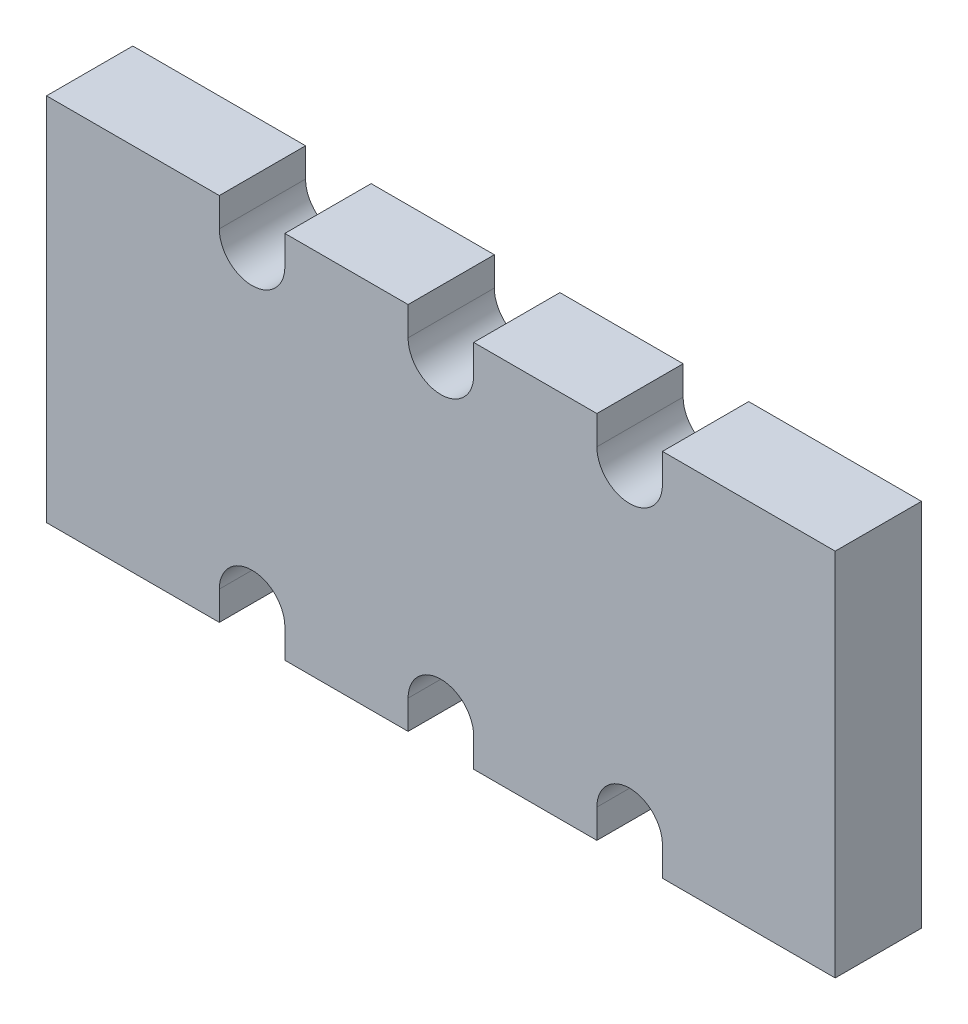
ISO-10303-21;
HEADER;
FILE_DESCRIPTION(('STEP AP214'),'2;1');
FILE_NAME('part.step','',(''),(''),'','','');
FILE_SCHEMA(('AUTOMOTIVE_DESIGN { 1 0 10303 214 1 1 1 1 }'));
ENDSEC;
DATA;
#1=APPLICATION_CONTEXT('core data for automotive mechanical design processes');
#2=APPLICATION_PROTOCOL_DEFINITION('international standard','automotive_design',2000,#1);
#3=PRODUCT_CONTEXT('',#1,'mechanical');
#4=PRODUCT('Part','Part','',(#3));
#5=PRODUCT_RELATED_PRODUCT_CATEGORY('part','',(#4));
#6=PRODUCT_DEFINITION_FORMATION('','',#4);
#7=PRODUCT_DEFINITION_CONTEXT('part definition',#1,'design');
#8=PRODUCT_DEFINITION('design','',#6,#7);
#9=PRODUCT_DEFINITION_SHAPE('','',#8);
#10=(LENGTH_UNIT() NAMED_UNIT(*) SI_UNIT(.MILLI.,.METRE.));
#11=(NAMED_UNIT(*) PLANE_ANGLE_UNIT() SI_UNIT($,.RADIAN.));
#12=(NAMED_UNIT(*) SI_UNIT($,.STERADIAN.) SOLID_ANGLE_UNIT());
#13=UNCERTAINTY_MEASURE_WITH_UNIT(LENGTH_MEASURE(1.E-05),#10,'distance_accuracy_value','');
#14=(GEOMETRIC_REPRESENTATION_CONTEXT(3) GLOBAL_UNCERTAINTY_ASSIGNED_CONTEXT((#13)) GLOBAL_UNIT_ASSIGNED_CONTEXT((#10,
#11,#12)) REPRESENTATION_CONTEXT('',''));
#15=CARTESIAN_POINT('',(0.,0.,0.));
#16=DIRECTION('',(0.,0.,1.));
#17=DIRECTION('',(1.,0.,0.));
#18=AXIS2_PLACEMENT_3D('',#15,#16,#17);
#19=CARTESIAN_POINT('',(-2.00589794865208,0.,0.4));
#20=DIRECTION('',(0.,0.,-1.));
#21=DIRECTION('',(0.,1.,0.));
#22=AXIS2_PLACEMENT_3D('',#19,#20,#21);
#23=PLANE('',#22);
#24=DIRECTION('',(1.,0.,0.));
#25=VECTOR('',#24,1.);
#26=CARTESIAN_POINT('',(-2.00589794865208,0.75,0.4));
#27=LINE('',#26,#25);
#28=CARTESIAN_POINT('',(1.6,0.75,0.4));
#29=VERTEX_POINT('',#28);
#30=CARTESIAN_POINT('',(0.899,0.75,0.4));
#31=VERTEX_POINT('',#30);
#32=EDGE_CURVE('E228',#29,#31,#27,.F.);
#33=ORIENTED_EDGE('',*,*,#32,.T.);
#34=DIRECTION('',(0.,1.,0.));
#35=VECTOR('',#34,1.);
#36=CARTESIAN_POINT('',(0.899,0.7165,0.4));
#37=LINE('',#36,#35);
#38=CARTESIAN_POINT('',(0.899,0.633,0.4));
#39=VERTEX_POINT('',#38);
#40=EDGE_CURVE('E197',#31,#39,#37,.F.);
#41=ORIENTED_EDGE('',*,*,#40,.T.);
#42=CARTESIAN_POINT('',(0.766,0.633,0.4));
#43=DIRECTION('',(0.,0.,1.));
#44=DIRECTION('',(1.,0.,0.));
#45=AXIS2_PLACEMENT_3D('',#42,#43,#44);
#46=CIRCLE('',#45,0.133);
#47=CARTESIAN_POINT('',(0.633,0.633,0.4));
#48=VERTEX_POINT('',#47);
#49=EDGE_CURVE('E19',#39,#48,#46,.F.);
#50=ORIENTED_EDGE('',*,*,#49,.T.);
#51=DIRECTION('',(0.,-1.,0.));
#52=VECTOR('',#51,1.);
#53=CARTESIAN_POINT('',(0.633,0.716499999999994,0.4));
#54=LINE('',#53,#52);
#55=CARTESIAN_POINT('',(0.633,0.75,0.4));
#56=VERTEX_POINT('',#55);
#57=EDGE_CURVE('E201',#48,#56,#54,.F.);
#58=ORIENTED_EDGE('',*,*,#57,.T.);
#59=DIRECTION('',(1.,0.,0.));
#60=VECTOR('',#59,1.);
#61=CARTESIAN_POINT('',(-2.00589794865208,0.75,0.4));
#62=LINE('',#61,#60);
#63=CARTESIAN_POINT('',(0.133,0.75,0.4));
#64=VERTEX_POINT('',#63);
#65=EDGE_CURVE('E213',#56,#64,#62,.F.);
#66=ORIENTED_EDGE('',*,*,#65,.T.);
#67=DIRECTION('',(0.,1.,0.));
#68=VECTOR('',#67,1.);
#69=CARTESIAN_POINT('',(0.133,0.716499999999999,0.4));
#70=LINE('',#69,#68);
#71=CARTESIAN_POINT('',(0.133,0.633,0.4));
#72=VERTEX_POINT('',#71);
#73=EDGE_CURVE('E341',#64,#72,#70,.F.);
#74=ORIENTED_EDGE('',*,*,#73,.T.);
#75=CARTESIAN_POINT('',(0.,0.633,0.4));
#76=DIRECTION('',(0.,0.,1.));
#77=DIRECTION('',(1.,0.,0.));
#78=AXIS2_PLACEMENT_3D('',#75,#76,#77);
#79=CIRCLE('',#78,0.133);
#80=CARTESIAN_POINT('',(-0.133,0.633,0.4));
#81=VERTEX_POINT('',#80);
#82=EDGE_CURVE('E389',#72,#81,#79,.F.);
#83=ORIENTED_EDGE('',*,*,#82,.T.);
#84=DIRECTION('',(0.,-1.,0.));
#85=VECTOR('',#84,1.);
#86=CARTESIAN_POINT('',(-0.133,0.716499999999999,0.4));
#87=LINE('',#86,#85);
#88=CARTESIAN_POINT('',(-0.133,0.75,0.4));
#89=VERTEX_POINT('',#88);
#90=EDGE_CURVE('E336',#81,#89,#87,.F.);
#91=ORIENTED_EDGE('',*,*,#90,.T.);
#92=DIRECTION('',(1.,0.,0.));
#93=VECTOR('',#92,1.);
#94=CARTESIAN_POINT('',(-2.00589794865208,0.75,0.4));
#95=LINE('',#94,#93);
#96=CARTESIAN_POINT('',(-0.633,0.75,0.4));
#97=VERTEX_POINT('',#96);
#98=EDGE_CURVE('E331',#89,#97,#95,.F.);
#99=ORIENTED_EDGE('',*,*,#98,.T.);
#100=DIRECTION('',(0.,1.,0.));
#101=VECTOR('',#100,1.);
#102=CARTESIAN_POINT('',(-0.633,0.716499999999994,0.4));
#103=LINE('',#102,#101);
#104=CARTESIAN_POINT('',(-0.633,0.633,0.4));
#105=VERTEX_POINT('',#104);
#106=EDGE_CURVE('E325',#97,#105,#103,.F.);
#107=ORIENTED_EDGE('',*,*,#106,.T.);
#108=CARTESIAN_POINT('',(-0.766,0.633,0.4));
#109=DIRECTION('',(0.,0.,1.));
#110=DIRECTION('',(1.,0.,0.));
#111=AXIS2_PLACEMENT_3D('',#108,#109,#110);
#112=CIRCLE('',#111,0.133);
#113=CARTESIAN_POINT('',(-0.899,0.633,0.4));
#114=VERTEX_POINT('',#113);
#115=EDGE_CURVE('E388',#105,#114,#112,.F.);
#116=ORIENTED_EDGE('',*,*,#115,.T.);
#117=DIRECTION('',(0.,1.,0.));
#118=VECTOR('',#117,1.);
#119=CARTESIAN_POINT('',(-0.899,0.7165,0.4));
#120=LINE('',#119,#118);
#121=CARTESIAN_POINT('',(-0.899,0.75,0.4));
#122=VERTEX_POINT('',#121);
#123=EDGE_CURVE('E320',#114,#122,#120,.T.);
#124=ORIENTED_EDGE('',*,*,#123,.T.);
#125=DIRECTION('',(1.,0.,0.));
#126=VECTOR('',#125,1.);
#127=CARTESIAN_POINT('',(-2.00589794865208,0.75,0.4));
#128=LINE('',#127,#126);
#129=CARTESIAN_POINT('',(-1.6,0.75,0.4));
#130=VERTEX_POINT('',#129);
#131=EDGE_CURVE('E315',#122,#130,#128,.F.);
#132=ORIENTED_EDGE('',*,*,#131,.T.);
#133=DIRECTION('',(0.,1.,0.));
#134=VECTOR('',#133,1.);
#135=CARTESIAN_POINT('',(-1.6,0.,0.4));
#136=LINE('',#135,#134);
#137=CARTESIAN_POINT('',(-1.6,-0.75,0.4));
#138=VERTEX_POINT('',#137);
#139=EDGE_CURVE('E307',#130,#138,#136,.F.);
#140=ORIENTED_EDGE('',*,*,#139,.T.);
#141=DIRECTION('',(1.,0.,0.));
#142=VECTOR('',#141,1.);
#143=CARTESIAN_POINT('',(-2.00589794865208,-0.75,0.4));
#144=LINE('',#143,#142);
#145=CARTESIAN_POINT('',(-0.899,-0.75,0.4));
#146=VERTEX_POINT('',#145);
#147=EDGE_CURVE('E304',#138,#146,#144,.T.);
#148=ORIENTED_EDGE('',*,*,#147,.T.);
#149=DIRECTION('',(0.,1.,0.));
#150=VECTOR('',#149,1.);
#151=CARTESIAN_POINT('',(-0.899,-0.7165,0.4));
#152=LINE('',#151,#150);
#153=CARTESIAN_POINT('',(-0.899,-0.633,0.4));
#154=VERTEX_POINT('',#153);
#155=EDGE_CURVE('E298',#146,#154,#152,.T.);
#156=ORIENTED_EDGE('',*,*,#155,.T.);
#157=CARTESIAN_POINT('',(-0.766,-0.633,0.4));
#158=DIRECTION('',(0.,0.,1.));
#159=DIRECTION('',(1.,0.,0.));
#160=AXIS2_PLACEMENT_3D('',#157,#158,#159);
#161=CIRCLE('',#160,0.133);
#162=CARTESIAN_POINT('',(-0.633,-0.633,0.4));
#163=VERTEX_POINT('',#162);
#164=EDGE_CURVE('E386',#154,#163,#161,.F.);
#165=ORIENTED_EDGE('',*,*,#164,.T.);
#166=DIRECTION('',(0.,1.,0.));
#167=VECTOR('',#166,1.);
#168=CARTESIAN_POINT('',(-0.633,-0.716499999999994,0.4));
#169=LINE('',#168,#167);
#170=CARTESIAN_POINT('',(-0.633,-0.75,0.4));
#171=VERTEX_POINT('',#170);
#172=EDGE_CURVE('E290',#163,#171,#169,.F.);
#173=ORIENTED_EDGE('',*,*,#172,.T.);
#174=DIRECTION('',(1.,0.,0.));
#175=VECTOR('',#174,1.);
#176=CARTESIAN_POINT('',(-2.00589794865208,-0.75,0.4));
#177=LINE('',#176,#175);
#178=CARTESIAN_POINT('',(-0.133,-0.75,0.4));
#179=VERTEX_POINT('',#178);
#180=EDGE_CURVE('E287',#171,#179,#177,.T.);
#181=ORIENTED_EDGE('',*,*,#180,.T.);
#182=DIRECTION('',(0.,-1.,0.));
#183=VECTOR('',#182,1.);
#184=CARTESIAN_POINT('',(-0.133,-0.716499999999999,0.4));
#185=LINE('',#184,#183);
#186=CARTESIAN_POINT('',(-0.133,-0.633,0.4));
#187=VERTEX_POINT('',#186);
#188=EDGE_CURVE('E281',#179,#187,#185,.F.);
#189=ORIENTED_EDGE('',*,*,#188,.T.);
#190=CARTESIAN_POINT('',(0.,-0.633,0.4));
#191=DIRECTION('',(0.,0.,1.));
#192=DIRECTION('',(1.,0.,0.));
#193=AXIS2_PLACEMENT_3D('',#190,#191,#192);
#194=CIRCLE('',#193,0.133);
#195=CARTESIAN_POINT('',(0.133,-0.633,0.4));
#196=VERTEX_POINT('',#195);
#197=EDGE_CURVE('E384',#187,#196,#194,.F.);
#198=ORIENTED_EDGE('',*,*,#197,.T.);
#199=DIRECTION('',(0.,1.,0.));
#200=VECTOR('',#199,1.);
#201=CARTESIAN_POINT('',(0.133,-0.716499999999999,0.4));
#202=LINE('',#201,#200);
#203=CARTESIAN_POINT('',(0.133,-0.75,0.4));
#204=VERTEX_POINT('',#203);
#205=EDGE_CURVE('E276',#196,#204,#202,.F.);
#206=ORIENTED_EDGE('',*,*,#205,.T.);
#207=DIRECTION('',(1.,0.,0.));
#208=VECTOR('',#207,1.);
#209=CARTESIAN_POINT('',(-2.00589794865208,-0.75,0.4));
#210=LINE('',#209,#208);
#211=CARTESIAN_POINT('',(0.633,-0.75,0.4));
#212=VERTEX_POINT('',#211);
#213=EDGE_CURVE('E271',#204,#212,#210,.T.);
#214=ORIENTED_EDGE('',*,*,#213,.T.);
#215=DIRECTION('',(0.,-1.,0.));
#216=VECTOR('',#215,1.);
#217=CARTESIAN_POINT('',(0.633,-0.716499999999994,0.4));
#218=LINE('',#217,#216);
#219=CARTESIAN_POINT('',(0.633,-0.633,0.4));
#220=VERTEX_POINT('',#219);
#221=EDGE_CURVE('E265',#212,#220,#218,.F.);
#222=ORIENTED_EDGE('',*,*,#221,.T.);
#223=CARTESIAN_POINT('',(0.766,-0.633,0.4));
#224=DIRECTION('',(0.,0.,1.));
#225=DIRECTION('',(1.,0.,0.));
#226=AXIS2_PLACEMENT_3D('',#223,#224,#225);
#227=CIRCLE('',#226,0.133);
#228=CARTESIAN_POINT('',(0.899,-0.633,0.4));
#229=VERTEX_POINT('',#228);
#230=EDGE_CURVE('E382',#220,#229,#227,.F.);
#231=ORIENTED_EDGE('',*,*,#230,.T.);
#232=DIRECTION('',(0.,1.,0.));
#233=VECTOR('',#232,1.);
#234=CARTESIAN_POINT('',(0.899,-0.7165,0.4));
#235=LINE('',#234,#233);
#236=CARTESIAN_POINT('',(0.899,-0.75,0.4));
#237=VERTEX_POINT('',#236);
#238=EDGE_CURVE('E260',#229,#237,#235,.F.);
#239=ORIENTED_EDGE('',*,*,#238,.T.);
#240=DIRECTION('',(1.,0.,0.));
#241=VECTOR('',#240,1.);
#242=CARTESIAN_POINT('',(-2.00589794865208,-0.75,0.4));
#243=LINE('',#242,#241);
#244=CARTESIAN_POINT('',(1.6,-0.75,0.4));
#245=VERTEX_POINT('',#244);
#246=EDGE_CURVE('E249',#237,#245,#243,.T.);
#247=ORIENTED_EDGE('',*,*,#246,.T.);
#248=DIRECTION('',(0.,1.,0.));
#249=VECTOR('',#248,1.);
#250=CARTESIAN_POINT('',(1.6,0.,0.4));
#251=LINE('',#250,#249);
#252=EDGE_CURVE('E247',#29,#245,#251,.F.);
#253=ORIENTED_EDGE('',*,*,#252,.F.);
#254=EDGE_LOOP('',(#33,#41,#50,#58,#66,#74,#83,#91,#99,#107,#116,#124,#132,#140,#148,#156,#165,
#173,#181,#189,#198,#206,#214,#222,#231,#239,#247,#253));
#255=FACE_BOUND('',#254,.T.);
#256=ADVANCED_FACE('F16',(#255),#23,.F.);
#257=CARTESIAN_POINT('',(-2.00589794865208,0.75,0.225));
#258=DIRECTION('',(0.,-1.,0.));
#259=DIRECTION('',(0.,0.,-1.));
#260=AXIS2_PLACEMENT_3D('',#257,#258,#259);
#261=PLANE('',#260);
#262=DIRECTION('',(1.,0.,0.));
#263=VECTOR('',#262,1.);
#264=CARTESIAN_POINT('',(-2.00589794865208,0.75,0.05));
#265=LINE('',#264,#263);
#266=CARTESIAN_POINT('',(1.6,0.75,0.05));
#267=VERTEX_POINT('',#266);
#268=CARTESIAN_POINT('',(0.899,0.75,0.05));
#269=VERTEX_POINT('',#268);
#270=EDGE_CURVE('E231',#267,#269,#265,.F.);
#271=ORIENTED_EDGE('',*,*,#270,.T.);
#272=DIRECTION('',(0.,0.,-1.));
#273=VECTOR('',#272,1.);
#274=CARTESIAN_POINT('',(0.899,0.75,-3.15589794642056));
#275=LINE('',#274,#273);
#276=EDGE_CURVE('E225',#269,#31,#275,.F.);
#277=ORIENTED_EDGE('',*,*,#276,.T.);
#278=ORIENTED_EDGE('',*,*,#32,.F.);
#279=DIRECTION('',(0.,0.,-1.));
#280=VECTOR('',#279,1.);
#281=CARTESIAN_POINT('',(1.6,0.75,0.225));
#282=LINE('',#281,#280);
#283=EDGE_CURVE('E235',#267,#29,#282,.F.);
#284=ORIENTED_EDGE('',*,*,#283,.F.);
#285=EDGE_LOOP('',(#271,#277,#278,#284));
#286=FACE_BOUND('',#285,.T.);
#287=ADVANCED_FACE('F862',(#286),#261,.F.);
#288=CARTESIAN_POINT('',(0.899,0.7165,-3.15589794642056));
#289=DIRECTION('',(1.,0.,0.));
#290=DIRECTION('',(0.,0.,-1.));
#291=AXIS2_PLACEMENT_3D('',#288,#289,#290);
#292=PLANE('',#291);
#293=ORIENTED_EDGE('',*,*,#276,.F.);
#294=DIRECTION('',(0.,-1.,0.));
#295=VECTOR('',#294,1.);
#296=CARTESIAN_POINT('',(0.899,0.375,0.05));
#297=LINE('',#296,#295);
#298=CARTESIAN_POINT('',(0.899,0.633,0.0500000000000001));
#299=VERTEX_POINT('',#298);
#300=EDGE_CURVE('E234',#269,#299,#297,.T.);
#301=ORIENTED_EDGE('',*,*,#300,.T.);
#302=DIRECTION('',(0.,0.,1.));
#303=VECTOR('',#302,1.);
#304=CARTESIAN_POINT('',(0.899,0.633,-3.15589794642056));
#305=LINE('',#304,#303);
#306=EDGE_CURVE('E207',#299,#39,#305,.T.);
#307=ORIENTED_EDGE('',*,*,#306,.T.);
#308=ORIENTED_EDGE('',*,*,#40,.F.);
#309=EDGE_LOOP('',(#293,#301,#307,#308));
#310=FACE_BOUND('',#309,.T.);
#311=ADVANCED_FACE('F853',(#310),#292,.F.);
#312=CARTESIAN_POINT('',(0.766,0.633,-3.15589794642056));
#313=DIRECTION('',(0.,0.,1.));
#314=DIRECTION('',(1.,0.,0.));
#315=AXIS2_PLACEMENT_3D('',#312,#313,#314);
#316=CYLINDRICAL_SURFACE('',#315,0.133);
#317=ORIENTED_EDGE('',*,*,#306,.F.);
#318=CARTESIAN_POINT('',(0.766,0.633,0.0500000000000001));
#319=DIRECTION('',(0.,0.,1.));
#320=DIRECTION('',(1.,0.,0.));
#321=AXIS2_PLACEMENT_3D('',#318,#319,#320);
#322=CIRCLE('',#321,0.133);
#323=CARTESIAN_POINT('',(0.633,0.633,0.0500000000000001));
#324=VERTEX_POINT('',#323);
#325=EDGE_CURVE('E218',#299,#324,#322,.F.);
#326=ORIENTED_EDGE('',*,*,#325,.T.);
#327=DIRECTION('',(0.,0.,1.));
#328=VECTOR('',#327,1.);
#329=CARTESIAN_POINT('',(0.633,0.633,-3.15589794642056));
#330=LINE('',#329,#328);
#331=EDGE_CURVE('E206',#324,#48,#330,.T.);
#332=ORIENTED_EDGE('',*,*,#331,.T.);
#333=ORIENTED_EDGE('',*,*,#49,.F.);
#334=EDGE_LOOP('',(#317,#326,#332,#333));
#335=FACE_BOUND('',#334,.T.);
#336=ADVANCED_FACE('F216',(#335),#316,.F.);
#337=CARTESIAN_POINT('',(0.633,0.716499999999994,-3.15589794642056));
#338=DIRECTION('',(-1.,0.,0.));
#339=DIRECTION('',(0.,-1.,0.));
#340=AXIS2_PLACEMENT_3D('',#337,#338,#339);
#341=PLANE('',#340);
#342=ORIENTED_EDGE('',*,*,#331,.F.);
#343=DIRECTION('',(0.,-1.,0.));
#344=VECTOR('',#343,1.);
#345=CARTESIAN_POINT('',(0.633,0.375,0.05));
#346=LINE('',#345,#344);
#347=CARTESIAN_POINT('',(0.633,0.75,0.05));
#348=VERTEX_POINT('',#347);
#349=EDGE_CURVE('E381',#324,#348,#346,.F.);
#350=ORIENTED_EDGE('',*,*,#349,.T.);
#351=DIRECTION('',(0.,0.,-1.));
#352=VECTOR('',#351,1.);
#353=CARTESIAN_POINT('',(0.633,0.75,0.225));
#354=LINE('',#353,#352);
#355=EDGE_CURVE('E212',#348,#56,#354,.F.);
#356=ORIENTED_EDGE('',*,*,#355,.T.);
#357=ORIENTED_EDGE('',*,*,#57,.F.);
#358=EDGE_LOOP('',(#342,#350,#356,#357));
#359=FACE_BOUND('',#358,.T.);
#360=ADVANCED_FACE('F209',(#359),#341,.F.);
#361=CARTESIAN_POINT('',(-2.00589794865208,0.75,0.225));
#362=DIRECTION('',(0.,-1.,0.));
#363=DIRECTION('',(0.,0.,-1.));
#364=AXIS2_PLACEMENT_3D('',#361,#362,#363);
#365=PLANE('',#364);
#366=DIRECTION('',(1.,0.,0.));
#367=VECTOR('',#366,1.);
#368=CARTESIAN_POINT('',(-2.00589794865208,0.75,0.05));
#369=LINE('',#368,#367);
#370=CARTESIAN_POINT('',(0.133,0.75,0.05));
#371=VERTEX_POINT('',#370);
#372=EDGE_CURVE('E405',#348,#371,#369,.F.);
#373=ORIENTED_EDGE('',*,*,#372,.T.);
#374=DIRECTION('',(0.,0.,1.));
#375=VECTOR('',#374,1.);
#376=CARTESIAN_POINT('',(0.133,0.75,-3.15589794642056));
#377=LINE('',#376,#375);
#378=EDGE_CURVE('E344',#371,#64,#377,.T.);
#379=ORIENTED_EDGE('',*,*,#378,.T.);
#380=ORIENTED_EDGE('',*,*,#65,.F.);
#381=ORIENTED_EDGE('',*,*,#355,.F.);
#382=EDGE_LOOP('',(#373,#379,#380,#381));
#383=FACE_BOUND('',#382,.T.);
#384=ADVANCED_FACE('F828',(#383),#365,.F.);
#385=CARTESIAN_POINT('',(0.133,0.716499999999999,-3.15589794642056));
#386=DIRECTION('',(1.,0.,0.));
#387=DIRECTION('',(0.,1.,0.));
#388=AXIS2_PLACEMENT_3D('',#385,#386,#387);
#389=PLANE('',#388);
#390=ORIENTED_EDGE('',*,*,#378,.F.);
#391=DIRECTION('',(0.,-1.,0.));
#392=VECTOR('',#391,1.);
#393=CARTESIAN_POINT('',(0.133,0.375,0.05));
#394=LINE('',#393,#392);
#395=CARTESIAN_POINT('',(0.133,0.633,0.0500000000000001));
#396=VERTEX_POINT('',#395);
#397=EDGE_CURVE('E379',#371,#396,#394,.T.);
#398=ORIENTED_EDGE('',*,*,#397,.T.);
#399=DIRECTION('',(0.,0.,1.));
#400=VECTOR('',#399,1.);
#401=CARTESIAN_POINT('',(0.133,0.633,-3.15589794642056));
#402=LINE('',#401,#400);
#403=EDGE_CURVE('E343',#396,#72,#402,.T.);
#404=ORIENTED_EDGE('',*,*,#403,.T.);
#405=ORIENTED_EDGE('',*,*,#73,.F.);
#406=EDGE_LOOP('',(#390,#398,#404,#405));
#407=FACE_BOUND('',#406,.T.);
#408=ADVANCED_FACE('F818',(#407),#389,.F.);
#409=CARTESIAN_POINT('',(0.,0.633,-3.15589794642056));
#410=DIRECTION('',(0.,0.,1.));
#411=DIRECTION('',(1.,0.,0.));
#412=AXIS2_PLACEMENT_3D('',#409,#410,#411);
#413=CYLINDRICAL_SURFACE('',#412,0.133);
#414=ORIENTED_EDGE('',*,*,#403,.F.);
#415=CARTESIAN_POINT('',(0.,0.633,0.0500000000000001));
#416=DIRECTION('',(0.,0.,1.));
#417=DIRECTION('',(1.,0.,0.));
#418=AXIS2_PLACEMENT_3D('',#415,#416,#417);
#419=CIRCLE('',#418,0.133);
#420=CARTESIAN_POINT('',(-0.133,0.633,0.0500000000000001));
#421=VERTEX_POINT('',#420);
#422=EDGE_CURVE('E375',#396,#421,#419,.F.);
#423=ORIENTED_EDGE('',*,*,#422,.T.);
#424=DIRECTION('',(0.,0.,1.));
#425=VECTOR('',#424,1.);
#426=CARTESIAN_POINT('',(-0.133,0.633,-3.15589794642056));
#427=LINE('',#426,#425);
#428=EDGE_CURVE('E338',#421,#81,#427,.T.);
#429=ORIENTED_EDGE('',*,*,#428,.T.);
#430=ORIENTED_EDGE('',*,*,#82,.F.);
#431=EDGE_LOOP('',(#414,#423,#429,#430));
#432=FACE_BOUND('',#431,.T.);
#433=ADVANCED_FACE('F809',(#432),#413,.F.);
#434=CARTESIAN_POINT('',(-0.133,0.716499999999999,-3.15589794642056));
#435=DIRECTION('',(-1.,0.,0.));
#436=DIRECTION('',(0.,-1.,0.));
#437=AXIS2_PLACEMENT_3D('',#434,#435,#436);
#438=PLANE('',#437);
#439=ORIENTED_EDGE('',*,*,#428,.F.);
#440=DIRECTION('',(0.,-1.,0.));
#441=VECTOR('',#440,1.);
#442=CARTESIAN_POINT('',(-0.133,0.375,0.05));
#443=LINE('',#442,#441);
#444=CARTESIAN_POINT('',(-0.133,0.75,0.05));
#445=VERTEX_POINT('',#444);
#446=EDGE_CURVE('E378',#421,#445,#443,.F.);
#447=ORIENTED_EDGE('',*,*,#446,.T.);
#448=DIRECTION('',(0.,0.,-1.));
#449=VECTOR('',#448,1.);
#450=CARTESIAN_POINT('',(-0.133,0.75,0.225));
#451=LINE('',#450,#449);
#452=EDGE_CURVE('E333',#445,#89,#451,.F.);
#453=ORIENTED_EDGE('',*,*,#452,.T.);
#454=ORIENTED_EDGE('',*,*,#90,.F.);
#455=EDGE_LOOP('',(#439,#447,#453,#454));
#456=FACE_BOUND('',#455,.T.);
#457=ADVANCED_FACE('F516',(#456),#438,.F.);
#458=CARTESIAN_POINT('',(-2.00589794865208,0.75,0.225));
#459=DIRECTION('',(0.,-1.,0.));
#460=DIRECTION('',(0.,0.,-1.));
#461=AXIS2_PLACEMENT_3D('',#458,#459,#460);
#462=PLANE('',#461);
#463=ORIENTED_EDGE('',*,*,#98,.F.);
#464=ORIENTED_EDGE('',*,*,#452,.F.);
#465=DIRECTION('',(1.,0.,0.));
#466=VECTOR('',#465,1.);
#467=CARTESIAN_POINT('',(-2.00589794865208,0.75,0.05));
#468=LINE('',#467,#466);
#469=CARTESIAN_POINT('',(-0.633,0.75,0.05));
#470=VERTEX_POINT('',#469);
#471=EDGE_CURVE('E507',#445,#470,#468,.F.);
#472=ORIENTED_EDGE('',*,*,#471,.T.);
#473=DIRECTION('',(0.,0.,1.));
#474=VECTOR('',#473,1.);
#475=CARTESIAN_POINT('',(-0.633,0.75,-3.15589794642056));
#476=LINE('',#475,#474);
#477=EDGE_CURVE('E328',#470,#97,#476,.T.);
#478=ORIENTED_EDGE('',*,*,#477,.T.);
#479=EDGE_LOOP('',(#463,#464,#472,#478));
#480=FACE_BOUND('',#479,.T.);
#481=ADVANCED_FACE('F521',(#480),#462,.F.);
#482=CARTESIAN_POINT('',(-0.633,0.716499999999994,-3.15589794642056));
#483=DIRECTION('',(1.,0.,0.));
#484=DIRECTION('',(0.,1.,0.));
#485=AXIS2_PLACEMENT_3D('',#482,#483,#484);
#486=PLANE('',#485);
#487=ORIENTED_EDGE('',*,*,#477,.F.);
#488=DIRECTION('',(0.,-1.,0.));
#489=VECTOR('',#488,1.);
#490=CARTESIAN_POINT('',(-0.633,0.375,0.05));
#491=LINE('',#490,#489);
#492=CARTESIAN_POINT('',(-0.633,0.633,0.0500000000000001));
#493=VERTEX_POINT('',#492);
#494=EDGE_CURVE('E374',#470,#493,#491,.T.);
#495=ORIENTED_EDGE('',*,*,#494,.T.);
#496=DIRECTION('',(0.,0.,1.));
#497=VECTOR('',#496,1.);
#498=CARTESIAN_POINT('',(-0.633,0.633,-3.15589794642056));
#499=LINE('',#498,#497);
#500=EDGE_CURVE('E327',#493,#105,#499,.T.);
#501=ORIENTED_EDGE('',*,*,#500,.T.);
#502=ORIENTED_EDGE('',*,*,#106,.F.);
#503=EDGE_LOOP('',(#487,#495,#501,#502));
#504=FACE_BOUND('',#503,.T.);
#505=ADVANCED_FACE('F626',(#504),#486,.F.);
#506=CARTESIAN_POINT('',(-0.766,0.633,-3.15589794642056));
#507=DIRECTION('',(0.,0.,1.));
#508=DIRECTION('',(1.,0.,0.));
#509=AXIS2_PLACEMENT_3D('',#506,#507,#508);
#510=CYLINDRICAL_SURFACE('',#509,0.133);
#511=ORIENTED_EDGE('',*,*,#500,.F.);
#512=CARTESIAN_POINT('',(-0.766,0.633,0.0500000000000001));
#513=DIRECTION('',(0.,0.,1.));
#514=DIRECTION('',(1.,0.,0.));
#515=AXIS2_PLACEMENT_3D('',#512,#513,#514);
#516=CIRCLE('',#515,0.133);
#517=CARTESIAN_POINT('',(-0.899,0.633,0.0500000000000001));
#518=VERTEX_POINT('',#517);
#519=EDGE_CURVE('E370',#493,#518,#516,.F.);
#520=ORIENTED_EDGE('',*,*,#519,.T.);
#521=DIRECTION('',(0.,0.,1.));
#522=VECTOR('',#521,1.);
#523=CARTESIAN_POINT('',(-0.899,0.633,-3.15589794642056));
#524=LINE('',#523,#522);
#525=EDGE_CURVE('E322',#518,#114,#524,.T.);
#526=ORIENTED_EDGE('',*,*,#525,.T.);
#527=ORIENTED_EDGE('',*,*,#115,.F.);
#528=EDGE_LOOP('',(#511,#520,#526,#527));
#529=FACE_BOUND('',#528,.T.);
#530=ADVANCED_FACE('F623',(#529),#510,.F.);
#531=CARTESIAN_POINT('',(-0.899,0.7165,-3.15589794642056));
#532=DIRECTION('',(-1.,0.,0.));
#533=DIRECTION('',(0.,0.,1.));
#534=AXIS2_PLACEMENT_3D('',#531,#532,#533);
#535=PLANE('',#534);
#536=ORIENTED_EDGE('',*,*,#525,.F.);
#537=DIRECTION('',(0.,-1.,0.));
#538=VECTOR('',#537,1.);
#539=CARTESIAN_POINT('',(-0.899,0.375,0.05));
#540=LINE('',#539,#538);
#541=CARTESIAN_POINT('',(-0.899,0.75,0.05));
#542=VERTEX_POINT('',#541);
#543=EDGE_CURVE('E373',#518,#542,#540,.F.);
#544=ORIENTED_EDGE('',*,*,#543,.T.);
#545=DIRECTION('',(0.,0.,-1.));
#546=VECTOR('',#545,1.);
#547=CARTESIAN_POINT('',(-0.899,0.75,0.225));
#548=LINE('',#547,#546);
#549=EDGE_CURVE('E317',#542,#122,#548,.F.);
#550=ORIENTED_EDGE('',*,*,#549,.T.);
#551=ORIENTED_EDGE('',*,*,#123,.F.);
#552=EDGE_LOOP('',(#536,#544,#550,#551));
#553=FACE_BOUND('',#552,.T.);
#554=ADVANCED_FACE('F621',(#553),#535,.F.);
#555=CARTESIAN_POINT('',(-2.00589794865208,0.75,0.225));
#556=DIRECTION('',(0.,-1.,0.));
#557=DIRECTION('',(0.,0.,-1.));
#558=AXIS2_PLACEMENT_3D('',#555,#556,#557);
#559=PLANE('',#558);
#560=ORIENTED_EDGE('',*,*,#131,.F.);
#561=ORIENTED_EDGE('',*,*,#549,.F.);
#562=DIRECTION('',(1.,0.,0.));
#563=VECTOR('',#562,1.);
#564=CARTESIAN_POINT('',(-2.00589794865208,0.75,0.05));
#565=LINE('',#564,#563);
#566=CARTESIAN_POINT('',(-1.6,0.75,0.05));
#567=VERTEX_POINT('',#566);
#568=EDGE_CURVE('E484',#542,#567,#565,.F.);
#569=ORIENTED_EDGE('',*,*,#568,.T.);
#570=DIRECTION('',(0.,0.,-1.));
#571=VECTOR('',#570,1.);
#572=CARTESIAN_POINT('',(-1.6,0.75,0.225));
#573=LINE('',#572,#571);
#574=EDGE_CURVE('E312',#567,#130,#573,.F.);
#575=ORIENTED_EDGE('',*,*,#574,.T.);
#576=EDGE_LOOP('',(#560,#561,#569,#575));
#577=FACE_BOUND('',#576,.T.);
#578=ADVANCED_FACE('F618',(#577),#559,.F.);
#579=CARTESIAN_POINT('',(-1.6,0.,0.225));
#580=DIRECTION('',(1.,0.,0.));
#581=DIRECTION('',(0.,0.,-1.));
#582=AXIS2_PLACEMENT_3D('',#579,#580,#581);
#583=PLANE('',#582);
#584=ORIENTED_EDGE('',*,*,#574,.F.);
#585=DIRECTION('',(0.,-1.,0.));
#586=VECTOR('',#585,1.);
#587=CARTESIAN_POINT('',(-1.6,0.375,0.05));
#588=LINE('',#587,#586);
#589=CARTESIAN_POINT('',(-1.6,-0.75,0.0500000000000001));
#590=VERTEX_POINT('',#589);
#591=EDGE_CURVE('E475',#567,#590,#588,.T.);
#592=ORIENTED_EDGE('',*,*,#591,.T.);
#593=DIRECTION('',(0.,0.,1.));
#594=VECTOR('',#593,1.);
#595=CARTESIAN_POINT('',(-1.6,-0.75,0.225));
#596=LINE('',#595,#594);
#597=EDGE_CURVE('E306',#590,#138,#596,.T.);
#598=ORIENTED_EDGE('',*,*,#597,.T.);
#599=ORIENTED_EDGE('',*,*,#139,.F.);
#600=EDGE_LOOP('',(#584,#592,#598,#599));
#601=FACE_BOUND('',#600,.T.);
#602=ADVANCED_FACE('F614',(#601),#583,.F.);
#603=CARTESIAN_POINT('',(-2.00589794865208,-0.75,0.225));
#604=DIRECTION('',(0.,1.,0.));
#605=DIRECTION('',(0.,0.,1.));
#606=AXIS2_PLACEMENT_3D('',#603,#604,#605);
#607=PLANE('',#606);
#608=DIRECTION('',(1.,0.,0.));
#609=VECTOR('',#608,1.);
#610=CARTESIAN_POINT('',(-2.00589794865208,-0.75,0.0500000000000001));
#611=LINE('',#610,#609);
#612=CARTESIAN_POINT('',(-0.899,-0.75,0.0500000000000001));
#613=VERTEX_POINT('',#612);
#614=EDGE_CURVE('E472',#590,#613,#611,.T.);
#615=ORIENTED_EDGE('',*,*,#614,.T.);
#616=DIRECTION('',(0.,0.,1.));
#617=VECTOR('',#616,1.);
#618=CARTESIAN_POINT('',(-0.899,-0.75,-3.15589794642056));
#619=LINE('',#618,#617);
#620=EDGE_CURVE('E301',#613,#146,#619,.T.);
#621=ORIENTED_EDGE('',*,*,#620,.T.);
#622=ORIENTED_EDGE('',*,*,#147,.F.);
#623=ORIENTED_EDGE('',*,*,#597,.F.);
#624=EDGE_LOOP('',(#615,#621,#622,#623));
#625=FACE_BOUND('',#624,.T.);
#626=ADVANCED_FACE('F611',(#625),#607,.F.);
#627=CARTESIAN_POINT('',(-0.899,-0.7165,-3.15589794642056));
#628=DIRECTION('',(-1.,0.,0.));
#629=DIRECTION('',(0.,0.,1.));
#630=AXIS2_PLACEMENT_3D('',#627,#628,#629);
#631=PLANE('',#630);
#632=ORIENTED_EDGE('',*,*,#620,.F.);
#633=DIRECTION('',(0.,-1.,0.));
#634=VECTOR('',#633,1.);
#635=CARTESIAN_POINT('',(-0.899,0.375,0.05));
#636=LINE('',#635,#634);
#637=CARTESIAN_POINT('',(-0.899,-0.633,0.0500000000000001));
#638=VERTEX_POINT('',#637);
#639=EDGE_CURVE('E369',#613,#638,#636,.F.);
#640=ORIENTED_EDGE('',*,*,#639,.T.);
#641=DIRECTION('',(0.,0.,1.));
#642=VECTOR('',#641,1.);
#643=CARTESIAN_POINT('',(-0.899,-0.633,-3.15589794642056));
#644=LINE('',#643,#642);
#645=EDGE_CURVE('E300',#638,#154,#644,.T.);
#646=ORIENTED_EDGE('',*,*,#645,.T.);
#647=ORIENTED_EDGE('',*,*,#155,.F.);
#648=EDGE_LOOP('',(#632,#640,#646,#647));
#649=FACE_BOUND('',#648,.T.);
#650=ADVANCED_FACE('F607',(#649),#631,.F.);
#651=CARTESIAN_POINT('',(-0.766,-0.633,-3.15589794642056));
#652=DIRECTION('',(0.,0.,1.));
#653=DIRECTION('',(1.,0.,0.));
#654=AXIS2_PLACEMENT_3D('',#651,#652,#653);
#655=CYLINDRICAL_SURFACE('',#654,0.133);
#656=ORIENTED_EDGE('',*,*,#645,.F.);
#657=CARTESIAN_POINT('',(-0.766,-0.633,0.0500000000000001));
#658=DIRECTION('',(0.,0.,1.));
#659=DIRECTION('',(1.,0.,0.));
#660=AXIS2_PLACEMENT_3D('',#657,#658,#659);
#661=CIRCLE('',#660,0.133);
#662=CARTESIAN_POINT('',(-0.633,-0.633,0.0500000000000001));
#663=VERTEX_POINT('',#662);
#664=EDGE_CURVE('E365',#638,#663,#661,.F.);
#665=ORIENTED_EDGE('',*,*,#664,.T.);
#666=DIRECTION('',(0.,0.,1.));
#667=VECTOR('',#666,1.);
#668=CARTESIAN_POINT('',(-0.633,-0.633,-3.15589794642056));
#669=LINE('',#668,#667);
#670=EDGE_CURVE('E295',#663,#163,#669,.T.);
#671=ORIENTED_EDGE('',*,*,#670,.T.);
#672=ORIENTED_EDGE('',*,*,#164,.F.);
#673=EDGE_LOOP('',(#656,#665,#671,#672));
#674=FACE_BOUND('',#673,.T.);
#675=ADVANCED_FACE('F603',(#674),#655,.F.);
#676=CARTESIAN_POINT('',(-0.633,-0.716499999999994,-3.15589794642056));
#677=DIRECTION('',(1.,0.,0.));
#678=DIRECTION('',(0.,1.,0.));
#679=AXIS2_PLACEMENT_3D('',#676,#677,#678);
#680=PLANE('',#679);
#681=ORIENTED_EDGE('',*,*,#670,.F.);
#682=DIRECTION('',(0.,-1.,0.));
#683=VECTOR('',#682,1.);
#684=CARTESIAN_POINT('',(-0.633,0.375,0.05));
#685=LINE('',#684,#683);
#686=CARTESIAN_POINT('',(-0.633,-0.75,0.0500000000000001));
#687=VERTEX_POINT('',#686);
#688=EDGE_CURVE('E368',#663,#687,#685,.T.);
#689=ORIENTED_EDGE('',*,*,#688,.T.);
#690=DIRECTION('',(0.,0.,1.));
#691=VECTOR('',#690,1.);
#692=CARTESIAN_POINT('',(-0.633,-0.75,0.225));
#693=LINE('',#692,#691);
#694=EDGE_CURVE('E289',#687,#171,#693,.T.);
#695=ORIENTED_EDGE('',*,*,#694,.T.);
#696=ORIENTED_EDGE('',*,*,#172,.F.);
#697=EDGE_LOOP('',(#681,#689,#695,#696));
#698=FACE_BOUND('',#697,.T.);
#699=ADVANCED_FACE('F599',(#698),#680,.F.);
#700=CARTESIAN_POINT('',(-2.00589794865208,-0.75,0.225));
#701=DIRECTION('',(0.,1.,0.));
#702=DIRECTION('',(0.,0.,1.));
#703=AXIS2_PLACEMENT_3D('',#700,#701,#702);
#704=PLANE('',#703);
#705=DIRECTION('',(1.,0.,0.));
#706=VECTOR('',#705,1.);
#707=CARTESIAN_POINT('',(-2.00589794865208,-0.75,0.0500000000000001));
#708=LINE('',#707,#706);
#709=CARTESIAN_POINT('',(-0.133,-0.75,0.0500000000000001));
#710=VERTEX_POINT('',#709);
#711=EDGE_CURVE('E455',#687,#710,#708,.T.);
#712=ORIENTED_EDGE('',*,*,#711,.T.);
#713=DIRECTION('',(0.,0.,1.));
#714=VECTOR('',#713,1.);
#715=CARTESIAN_POINT('',(-0.133,-0.75,-3.15589794642056));
#716=LINE('',#715,#714);
#717=EDGE_CURVE('E284',#710,#179,#716,.T.);
#718=ORIENTED_EDGE('',*,*,#717,.T.);
#719=ORIENTED_EDGE('',*,*,#180,.F.);
#720=ORIENTED_EDGE('',*,*,#694,.F.);
#721=EDGE_LOOP('',(#712,#718,#719,#720));
#722=FACE_BOUND('',#721,.T.);
#723=ADVANCED_FACE('F596',(#722),#704,.F.);
#724=CARTESIAN_POINT('',(-0.133,-0.716499999999999,-3.15589794642056));
#725=DIRECTION('',(-1.,0.,0.));
#726=DIRECTION('',(0.,-1.,0.));
#727=AXIS2_PLACEMENT_3D('',#724,#725,#726);
#728=PLANE('',#727);
#729=ORIENTED_EDGE('',*,*,#717,.F.);
#730=DIRECTION('',(0.,-1.,0.));
#731=VECTOR('',#730,1.);
#732=CARTESIAN_POINT('',(-0.133,0.375,0.05));
#733=LINE('',#732,#731);
#734=CARTESIAN_POINT('',(-0.133,-0.633,0.0500000000000001));
#735=VERTEX_POINT('',#734);
#736=EDGE_CURVE('E364',#710,#735,#733,.F.);
#737=ORIENTED_EDGE('',*,*,#736,.T.);
#738=DIRECTION('',(0.,0.,1.));
#739=VECTOR('',#738,1.);
#740=CARTESIAN_POINT('',(-0.133,-0.633,-3.15589794642056));
#741=LINE('',#740,#739);
#742=EDGE_CURVE('E283',#735,#187,#741,.T.);
#743=ORIENTED_EDGE('',*,*,#742,.T.);
#744=ORIENTED_EDGE('',*,*,#188,.F.);
#745=EDGE_LOOP('',(#729,#737,#743,#744));
#746=FACE_BOUND('',#745,.T.);
#747=ADVANCED_FACE('F592',(#746),#728,.F.);
#748=CARTESIAN_POINT('',(0.,-0.633,-3.15589794642056));
#749=DIRECTION('',(0.,0.,1.));
#750=DIRECTION('',(1.,0.,0.));
#751=AXIS2_PLACEMENT_3D('',#748,#749,#750);
#752=CYLINDRICAL_SURFACE('',#751,0.133);
#753=ORIENTED_EDGE('',*,*,#742,.F.);
#754=CARTESIAN_POINT('',(0.,-0.633,0.0500000000000001));
#755=DIRECTION('',(0.,0.,1.));
#756=DIRECTION('',(1.,0.,0.));
#757=AXIS2_PLACEMENT_3D('',#754,#755,#756);
#758=CIRCLE('',#757,0.133);
#759=CARTESIAN_POINT('',(0.133,-0.633,0.0500000000000001));
#760=VERTEX_POINT('',#759);
#761=EDGE_CURVE('E360',#735,#760,#758,.F.);
#762=ORIENTED_EDGE('',*,*,#761,.T.);
#763=DIRECTION('',(0.,0.,1.));
#764=VECTOR('',#763,1.);
#765=CARTESIAN_POINT('',(0.133,-0.633,-3.15589794642056));
#766=LINE('',#765,#764);
#767=EDGE_CURVE('E278',#760,#196,#766,.T.);
#768=ORIENTED_EDGE('',*,*,#767,.T.);
#769=ORIENTED_EDGE('',*,*,#197,.F.);
#770=EDGE_LOOP('',(#753,#762,#768,#769));
#771=FACE_BOUND('',#770,.T.);
#772=ADVANCED_FACE('F588',(#771),#752,.F.);
#773=CARTESIAN_POINT('',(0.133,-0.716499999999999,-3.15589794642056));
#774=DIRECTION('',(1.,0.,0.));
#775=DIRECTION('',(0.,1.,0.));
#776=AXIS2_PLACEMENT_3D('',#773,#774,#775);
#777=PLANE('',#776);
#778=ORIENTED_EDGE('',*,*,#767,.F.);
#779=DIRECTION('',(0.,-1.,0.));
#780=VECTOR('',#779,1.);
#781=CARTESIAN_POINT('',(0.133,0.375,0.05));
#782=LINE('',#781,#780);
#783=CARTESIAN_POINT('',(0.133,-0.75,0.0500000000000001));
#784=VERTEX_POINT('',#783);
#785=EDGE_CURVE('E363',#760,#784,#782,.T.);
#786=ORIENTED_EDGE('',*,*,#785,.T.);
#787=DIRECTION('',(0.,0.,1.));
#788=VECTOR('',#787,1.);
#789=CARTESIAN_POINT('',(0.133,-0.75,0.225));
#790=LINE('',#789,#788);
#791=EDGE_CURVE('E273',#784,#204,#790,.T.);
#792=ORIENTED_EDGE('',*,*,#791,.T.);
#793=ORIENTED_EDGE('',*,*,#205,.F.);
#794=EDGE_LOOP('',(#778,#786,#792,#793));
#795=FACE_BOUND('',#794,.T.);
#796=ADVANCED_FACE('F584',(#795),#777,.F.);
#797=CARTESIAN_POINT('',(-2.00589794865208,-0.75,0.225));
#798=DIRECTION('',(0.,1.,0.));
#799=DIRECTION('',(0.,0.,1.));
#800=AXIS2_PLACEMENT_3D('',#797,#798,#799);
#801=PLANE('',#800);
#802=ORIENTED_EDGE('',*,*,#213,.F.);
#803=ORIENTED_EDGE('',*,*,#791,.F.);
#804=DIRECTION('',(1.,0.,0.));
#805=VECTOR('',#804,1.);
#806=CARTESIAN_POINT('',(-2.00589794865208,-0.75,0.0500000000000001));
#807=LINE('',#806,#805);
#808=CARTESIAN_POINT('',(0.633,-0.75,0.0500000000000001));
#809=VERTEX_POINT('',#808);
#810=EDGE_CURVE('E438',#784,#809,#807,.T.);
#811=ORIENTED_EDGE('',*,*,#810,.T.);
#812=DIRECTION('',(0.,0.,1.));
#813=VECTOR('',#812,1.);
#814=CARTESIAN_POINT('',(0.633,-0.75,-3.15589794642056));
#815=LINE('',#814,#813);
#816=EDGE_CURVE('E268',#809,#212,#815,.T.);
#817=ORIENTED_EDGE('',*,*,#816,.T.);
#818=EDGE_LOOP('',(#802,#803,#811,#817));
#819=FACE_BOUND('',#818,.T.);
#820=ADVANCED_FACE('F581',(#819),#801,.F.);
#821=CARTESIAN_POINT('',(0.633,-0.716499999999994,-3.15589794642056));
#822=DIRECTION('',(-1.,0.,0.));
#823=DIRECTION('',(0.,-1.,0.));
#824=AXIS2_PLACEMENT_3D('',#821,#822,#823);
#825=PLANE('',#824);
#826=ORIENTED_EDGE('',*,*,#816,.F.);
#827=DIRECTION('',(0.,-1.,0.));
#828=VECTOR('',#827,1.);
#829=CARTESIAN_POINT('',(0.633,0.375,0.05));
#830=LINE('',#829,#828);
#831=CARTESIAN_POINT('',(0.633,-0.633,0.0500000000000001));
#832=VERTEX_POINT('',#831);
#833=EDGE_CURVE('E359',#809,#832,#830,.F.);
#834=ORIENTED_EDGE('',*,*,#833,.T.);
#835=DIRECTION('',(0.,0.,1.));
#836=VECTOR('',#835,1.);
#837=CARTESIAN_POINT('',(0.633,-0.633,-3.15589794642056));
#838=LINE('',#837,#836);
#839=EDGE_CURVE('E267',#832,#220,#838,.T.);
#840=ORIENTED_EDGE('',*,*,#839,.T.);
#841=ORIENTED_EDGE('',*,*,#221,.F.);
#842=EDGE_LOOP('',(#826,#834,#840,#841));
#843=FACE_BOUND('',#842,.T.);
#844=ADVANCED_FACE('F576',(#843),#825,.F.);
#845=CARTESIAN_POINT('',(0.766,-0.633,-3.15589794642056));
#846=DIRECTION('',(0.,0.,1.));
#847=DIRECTION('',(1.,0.,0.));
#848=AXIS2_PLACEMENT_3D('',#845,#846,#847);
#849=CYLINDRICAL_SURFACE('',#848,0.133);
#850=ORIENTED_EDGE('',*,*,#839,.F.);
#851=CARTESIAN_POINT('',(0.766,-0.633,0.0500000000000001));
#852=DIRECTION('',(0.,0.,1.));
#853=DIRECTION('',(1.,0.,0.));
#854=AXIS2_PLACEMENT_3D('',#851,#852,#853);
#855=CIRCLE('',#854,0.133);
#856=CARTESIAN_POINT('',(0.899,-0.633,0.0500000000000001));
#857=VERTEX_POINT('',#856);
#858=EDGE_CURVE('E355',#832,#857,#855,.F.);
#859=ORIENTED_EDGE('',*,*,#858,.T.);
#860=DIRECTION('',(0.,0.,-1.));
#861=VECTOR('',#860,1.);
#862=CARTESIAN_POINT('',(0.899,-0.633,-3.15589794642056));
#863=LINE('',#862,#861);
#864=EDGE_CURVE('E262',#857,#229,#863,.F.);
#865=ORIENTED_EDGE('',*,*,#864,.T.);
#866=ORIENTED_EDGE('',*,*,#230,.F.);
#867=EDGE_LOOP('',(#850,#859,#865,#866));
#868=FACE_BOUND('',#867,.T.);
#869=ADVANCED_FACE('F572',(#868),#849,.F.);
#870=CARTESIAN_POINT('',(0.899,-0.7165,-3.15589794642056));
#871=DIRECTION('',(1.,0.,0.));
#872=DIRECTION('',(0.,0.,-1.));
#873=AXIS2_PLACEMENT_3D('',#870,#871,#872);
#874=PLANE('',#873);
#875=ORIENTED_EDGE('',*,*,#864,.F.);
#876=DIRECTION('',(0.,-1.,0.));
#877=VECTOR('',#876,1.);
#878=CARTESIAN_POINT('',(0.899,0.375,0.05));
#879=LINE('',#878,#877);
#880=CARTESIAN_POINT('',(0.899,-0.75,0.0500000000000001));
#881=VERTEX_POINT('',#880);
#882=EDGE_CURVE('E358',#857,#881,#879,.T.);
#883=ORIENTED_EDGE('',*,*,#882,.T.);
#884=DIRECTION('',(0.,0.,1.));
#885=VECTOR('',#884,1.);
#886=CARTESIAN_POINT('',(0.899,-0.75,0.225));
#887=LINE('',#886,#885);
#888=EDGE_CURVE('E254',#881,#237,#887,.T.);
#889=ORIENTED_EDGE('',*,*,#888,.T.);
#890=ORIENTED_EDGE('',*,*,#238,.F.);
#891=EDGE_LOOP('',(#875,#883,#889,#890));
#892=FACE_BOUND('',#891,.T.);
#893=ADVANCED_FACE('F567',(#892),#874,.F.);
#894=CARTESIAN_POINT('',(-2.00589794865208,-0.75,0.225));
#895=DIRECTION('',(0.,1.,0.));
#896=DIRECTION('',(0.,0.,1.));
#897=AXIS2_PLACEMENT_3D('',#894,#895,#896);
#898=PLANE('',#897);
#899=ORIENTED_EDGE('',*,*,#246,.F.);
#900=ORIENTED_EDGE('',*,*,#888,.F.);
#901=DIRECTION('',(1.,0.,0.));
#902=VECTOR('',#901,1.);
#903=CARTESIAN_POINT('',(-2.00589794865208,-0.75,0.0500000000000001));
#904=LINE('',#903,#902);
#905=CARTESIAN_POINT('',(1.6,-0.75,0.05));
#906=VERTEX_POINT('',#905);
#907=EDGE_CURVE('E25',#881,#906,#904,.T.);
#908=ORIENTED_EDGE('',*,*,#907,.T.);
#909=DIRECTION('',(0.,0.,-1.));
#910=VECTOR('',#909,1.);
#911=CARTESIAN_POINT('',(1.6,-0.75,0.225));
#912=LINE('',#911,#910);
#913=EDGE_CURVE('E33',#245,#906,#912,.T.);
#914=ORIENTED_EDGE('',*,*,#913,.F.);
#915=EDGE_LOOP('',(#899,#900,#908,#914));
#916=FACE_BOUND('',#915,.T.);
#917=ADVANCED_FACE('F630',(#916),#898,.F.);
#918=CARTESIAN_POINT('',(1.6,0.,0.225));
#919=DIRECTION('',(1.,0.,0.));
#920=DIRECTION('',(0.,0.,-1.));
#921=AXIS2_PLACEMENT_3D('',#918,#919,#920);
#922=PLANE('',#921);
#923=DIRECTION('',(0.,-1.,0.));
#924=VECTOR('',#923,1.);
#925=CARTESIAN_POINT('',(1.6,0.375,0.05));
#926=LINE('',#925,#924);
#927=EDGE_CURVE('E11',#906,#267,#926,.F.);
#928=ORIENTED_EDGE('',*,*,#927,.T.);
#929=ORIENTED_EDGE('',*,*,#283,.T.);
#930=ORIENTED_EDGE('',*,*,#252,.T.);
#931=ORIENTED_EDGE('',*,*,#913,.T.);
#932=EDGE_LOOP('',(#928,#929,#930,#931));
#933=FACE_BOUND('',#932,.T.);
#934=ADVANCED_FACE('F632',(#933),#922,.T.);
#935=CARTESIAN_POINT('',(-2.00589794865208,0.375,0.05));
#936=DIRECTION('',(0.,0.,1.));
#937=DIRECTION('',(0.,-1.,0.));
#938=AXIS2_PLACEMENT_3D('',#935,#936,#937);
#939=PLANE('',#938);
#940=ORIENTED_EDGE('',*,*,#907,.F.);
#941=ORIENTED_EDGE('',*,*,#882,.F.);
#942=ORIENTED_EDGE('',*,*,#858,.F.);
#943=ORIENTED_EDGE('',*,*,#833,.F.);
#944=ORIENTED_EDGE('',*,*,#810,.F.);
#945=ORIENTED_EDGE('',*,*,#785,.F.);
#946=ORIENTED_EDGE('',*,*,#761,.F.);
#947=ORIENTED_EDGE('',*,*,#736,.F.);
#948=ORIENTED_EDGE('',*,*,#711,.F.);
#949=ORIENTED_EDGE('',*,*,#688,.F.);
#950=ORIENTED_EDGE('',*,*,#664,.F.);
#951=ORIENTED_EDGE('',*,*,#639,.F.);
#952=ORIENTED_EDGE('',*,*,#614,.F.);
#953=ORIENTED_EDGE('',*,*,#591,.F.);
#954=ORIENTED_EDGE('',*,*,#568,.F.);
#955=ORIENTED_EDGE('',*,*,#543,.F.);
#956=ORIENTED_EDGE('',*,*,#519,.F.);
#957=ORIENTED_EDGE('',*,*,#494,.F.);
#958=ORIENTED_EDGE('',*,*,#471,.F.);
#959=ORIENTED_EDGE('',*,*,#446,.F.);
#960=ORIENTED_EDGE('',*,*,#422,.F.);
#961=ORIENTED_EDGE('',*,*,#397,.F.);
#962=ORIENTED_EDGE('',*,*,#372,.F.);
#963=ORIENTED_EDGE('',*,*,#349,.F.);
#964=ORIENTED_EDGE('',*,*,#325,.F.);
#965=ORIENTED_EDGE('',*,*,#300,.F.);
#966=ORIENTED_EDGE('',*,*,#270,.F.);
#967=ORIENTED_EDGE('',*,*,#927,.F.);
#968=EDGE_LOOP('',(#940,#941,#942,#943,#944,#945,#946,#947,#948,#949,#950,#951,#952,#953,#954,
#955,#956,#957,#958,#959,#960,#961,#962,#963,#964,#965,#966,#967));
#969=FACE_BOUND('',#968,.T.);
#970=ADVANCED_FACE('F525',(#969),#939,.F.);
#971=CLOSED_SHELL('',(#256,#287,#311,#336,#360,#384,#408,#433,#457,#481,#505,#530,#554,#578,
#602,#626,#650,#675,#699,#723,#747,#772,#796,#820,#844,#869,#893,#917,#934,#970));
#972=MANIFOLD_SOLID_BREP('B1',#971);
#973=ADVANCED_BREP_SHAPE_REPRESENTATION('',(#18,#972),#14);
#974=SHAPE_DEFINITION_REPRESENTATION(#9,#973);
ENDSEC;
END-ISO-10303-21;
